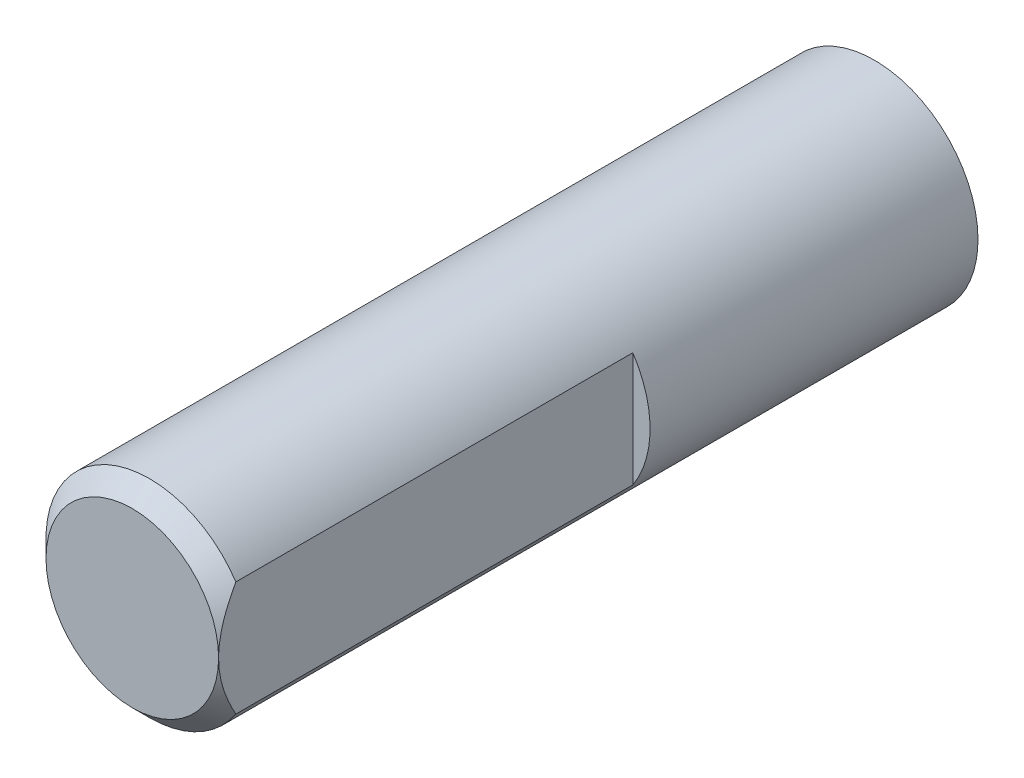
ISO-10303-21;
HEADER;
FILE_DESCRIPTION(('STEP AP214'),'2;1');
FILE_NAME('part.step','',(''),(''),'','','');
FILE_SCHEMA(('AUTOMOTIVE_DESIGN { 1 0 10303 214 1 1 1 1 }'));
ENDSEC;
DATA;
#1=APPLICATION_CONTEXT('core data for automotive mechanical design processes');
#2=APPLICATION_PROTOCOL_DEFINITION('international standard','automotive_design',2000,#1);
#3=PRODUCT_CONTEXT('',#1,'mechanical');
#4=PRODUCT('Part','Part','',(#3));
#5=PRODUCT_RELATED_PRODUCT_CATEGORY('part','',(#4));
#6=PRODUCT_DEFINITION_FORMATION('','',#4);
#7=PRODUCT_DEFINITION_CONTEXT('part definition',#1,'design');
#8=PRODUCT_DEFINITION('design','',#6,#7);
#9=PRODUCT_DEFINITION_SHAPE('','',#8);
#10=(LENGTH_UNIT() NAMED_UNIT(*) SI_UNIT(.MILLI.,.METRE.));
#11=(NAMED_UNIT(*) PLANE_ANGLE_UNIT() SI_UNIT($,.RADIAN.));
#12=(NAMED_UNIT(*) SI_UNIT($,.STERADIAN.) SOLID_ANGLE_UNIT());
#13=UNCERTAINTY_MEASURE_WITH_UNIT(LENGTH_MEASURE(1.E-05),#10,'distance_accuracy_value','');
#14=(GEOMETRIC_REPRESENTATION_CONTEXT(3) GLOBAL_UNCERTAINTY_ASSIGNED_CONTEXT((#13)) GLOBAL_UNIT_ASSIGNED_CONTEXT((#10,
#11,#12)) REPRESENTATION_CONTEXT('',''));
#15=CARTESIAN_POINT('',(0.,0.,0.));
#16=DIRECTION('',(0.,0.,1.));
#17=DIRECTION('',(1.,0.,0.));
#18=AXIS2_PLACEMENT_3D('',#15,#16,#17);
#19=CARTESIAN_POINT('',(0.,0.,21.5));
#20=DIRECTION('',(0.,0.,-1.));
#21=DIRECTION('',(-1.,0.,0.));
#22=AXIS2_PLACEMENT_3D('',#19,#20,#21);
#23=CYLINDRICAL_SURFACE('',#22,3.);
#24=DIRECTION('',(0.,0.,1.));
#25=VECTOR('',#24,1.);
#26=CARTESIAN_POINT('',(2.5,-1.6583123951777,9.5));
#27=LINE('',#26,#25);
#28=CARTESIAN_POINT('',(2.5,-1.6583123951777,9.5));
#29=VERTEX_POINT('',#28);
#30=CARTESIAN_POINT('',(2.5,-1.6583123951777,21.));
#31=VERTEX_POINT('',#30);
#32=EDGE_CURVE('E79',#29,#31,#27,.T.);
#33=ORIENTED_EDGE('',*,*,#32,.T.);
#34=CARTESIAN_POINT('',(0.,0.,21.));
#35=DIRECTION('',(0.,0.,1.));
#36=DIRECTION('',(1.,0.,0.));
#37=AXIS2_PLACEMENT_3D('',#34,#35,#36);
#38=CIRCLE('',#37,3.);
#39=CARTESIAN_POINT('',(2.5,1.6583123951777,21.));
#40=VERTEX_POINT('',#39);
#41=EDGE_CURVE('E11',#31,#40,#38,.F.);
#42=ORIENTED_EDGE('',*,*,#41,.T.);
#43=DIRECTION('',(0.,0.,1.));
#44=VECTOR('',#43,1.);
#45=CARTESIAN_POINT('',(2.5,1.6583123951777,9.5));
#46=LINE('',#45,#44);
#47=CARTESIAN_POINT('',(2.5,1.6583123951777,9.5));
#48=VERTEX_POINT('',#47);
#49=EDGE_CURVE('E77',#48,#40,#46,.T.);
#50=ORIENTED_EDGE('',*,*,#49,.F.);
#51=CARTESIAN_POINT('',(0.,0.,9.5));
#52=DIRECTION('',(0.,0.,1.));
#53=DIRECTION('',(1.,0.,0.));
#54=AXIS2_PLACEMENT_3D('',#51,#52,#53);
#55=CIRCLE('',#54,3.);
#56=EDGE_CURVE('E70',#29,#48,#55,.T.);
#57=ORIENTED_EDGE('',*,*,#56,.F.);
#58=EDGE_LOOP('',(#33,#42,#50,#57));
#59=FACE_BOUND('',#58,.T.);
#60=CARTESIAN_POINT('',(0.,0.,0.));
#61=DIRECTION('',(0.,0.,1.));
#62=DIRECTION('',(1.,0.,0.));
#63=AXIS2_PLACEMENT_3D('',#60,#61,#62);
#64=CIRCLE('',#63,3.);
#65=CARTESIAN_POINT('',(3.,0.,0.));
#66=VERTEX_POINT('',#65);
#67=EDGE_CURVE('E88',#66,#66,#64,.T.);
#68=ORIENTED_EDGE('',*,*,#67,.T.);
#69=EDGE_LOOP('',(#68));
#70=FACE_BOUND('',#69,.T.);
#71=ADVANCED_FACE('F38',(#59,#70),#23,.T.);
#72=CARTESIAN_POINT('',(0.,0.,21.5));
#73=DIRECTION('',(0.,0.,1.));
#74=DIRECTION('',(1.,0.,0.));
#75=AXIS2_PLACEMENT_3D('',#72,#73,#74);
#76=PLANE('',#75);
#77=CARTESIAN_POINT('',(0.,0.,21.5));
#78=DIRECTION('',(0.,0.,1.));
#79=DIRECTION('',(1.,0.,0.));
#80=AXIS2_PLACEMENT_3D('',#77,#78,#79);
#81=CIRCLE('',#80,2.5);
#82=CARTESIAN_POINT('',(2.5,0.,21.5));
#83=VERTEX_POINT('',#82);
#84=EDGE_CURVE('E94',#83,#83,#81,.T.);
#85=ORIENTED_EDGE('',*,*,#84,.T.);
#86=EDGE_LOOP('',(#85));
#87=FACE_BOUND('',#86,.T.);
#88=ADVANCED_FACE('F113',(#87),#76,.T.);
#89=CARTESIAN_POINT('',(0.,0.,0.));
#90=DIRECTION('',(0.,0.,1.));
#91=DIRECTION('',(1.,0.,0.));
#92=AXIS2_PLACEMENT_3D('',#89,#90,#91);
#93=PLANE('',#92);
#94=ORIENTED_EDGE('',*,*,#67,.F.);
#95=EDGE_LOOP('',(#94));
#96=FACE_BOUND('',#95,.T.);
#97=ADVANCED_FACE('F112',(#96),#93,.F.);
#98=CARTESIAN_POINT('',(2.5,1.6583123951777,9.5));
#99=DIRECTION('',(-1.,0.,0.));
#100=DIRECTION('',(0.,0.,1.));
#101=AXIS2_PLACEMENT_3D('',#98,#99,#100);
#102=PLANE('',#101);
#103=CARTESIAN_POINT('',(2.5,1.6583123951777,21.));
#104=CARTESIAN_POINT('',(2.5,1.61304419071273,21.0250200255843));
#105=CARTESIAN_POINT('',(2.5,1.56747781751027,21.049499427219));
#106=CARTESIAN_POINT('',(2.5,1.47571363154993,21.0972096867305));
#107=CARTESIAN_POINT('',(2.5,1.42951600534284,21.1204409038781));
#108=CARTESIAN_POINT('',(2.5,1.28946898250347,21.188233741468));
#109=CARTESIAN_POINT('',(2.5,1.19456817295725,21.2306685534991));
#110=CARTESIAN_POINT('',(2.5,1.00435832661106,21.3071641313579));
#111=CARTESIAN_POINT('',(2.5,0.909128166857117,21.3414185932365));
#112=CARTESIAN_POINT('',(2.5,0.715960996402805,21.4011186383457));
#113=CARTESIAN_POINT('',(2.5,0.618025975916641,21.4265705213043));
#114=CARTESIAN_POINT('',(2.5,0.434096531038006,21.46395141614));
#115=CARTESIAN_POINT('',(2.5,0.348395131920399,21.4772928993308));
#116=CARTESIAN_POINT('',(2.5,0.218706232970867,21.4908266543301));
#117=CARTESIAN_POINT('',(2.5,0.17504227488708,21.4942588205655));
#118=CARTESIAN_POINT('',(2.5,0.0875881850216984,21.4988484547413));
#119=CARTESIAN_POINT('',(2.5,0.0437980337548221,21.5000055502065));
#120=CARTESIAN_POINT('',(2.5,0.,21.5));
#121=B_SPLINE_CURVE_WITH_KNOTS('',3,(#103,#104,#105,#106,#107,#108,#109,#110,#111,#112,#113,
#114,#115,#116,#117,#118,#119,#120),.UNSPECIFIED.,.F.,.F.,(4,2,2,2,2,2,2,2,4),(0.,
0.155160114661541,0.310275326953931,0.621889187467566,0.925164565305232,1.22822244720193,
1.48798349653102,1.61932602447731,1.75069005406606),.UNSPECIFIED.);
#122=EDGE_CURVE('E97',#40,#83,#121,.T.);
#123=ORIENTED_EDGE('',*,*,#122,.T.);
#124=CARTESIAN_POINT('',(2.5,0.,21.5));
#125=CARTESIAN_POINT('',(2.5,-0.0768428391803911,21.5000643176381));
#126=CARTESIAN_POINT('',(2.5,-0.153646619440305,21.4964585669139));
#127=CARTESIAN_POINT('',(2.5,-0.306486913990631,21.4824138186156));
#128=CARTESIAN_POINT('',(2.5,-0.382524604614592,21.4719877566791));
#129=CARTESIAN_POINT('',(2.5,-0.532231201598341,21.4450231886171));
#130=CARTESIAN_POINT('',(2.5,-0.605918543015125,21.4285851348585));
#131=CARTESIAN_POINT('',(2.5,-0.751897163106768,21.3903277696489));
#132=CARTESIAN_POINT('',(2.5,-0.824187885624651,21.3685063602176));
#133=CARTESIAN_POINT('',(2.5,-0.961361204559369,21.3222417065684));
#134=CARTESIAN_POINT('',(2.5,-1.02636662586387,21.2981581621012));
#135=CARTESIAN_POINT('',(2.5,-1.15505562355539,21.2466971992364));
#136=CARTESIAN_POINT('',(2.5,-1.21873914323977,21.2193196398836));
#137=CARTESIAN_POINT('',(2.5,-1.34581351001767,21.1613450460911));
#138=CARTESIAN_POINT('',(2.5,-1.40918435962136,21.1307045192353));
#139=CARTESIAN_POINT('',(2.5,-1.53466113602633,21.067035036112));
#140=CARTESIAN_POINT('',(2.5,-1.59676793059763,21.0340077944289));
#141=CARTESIAN_POINT('',(2.5,-1.6583123951777,21.));
#142=B_SPLINE_CURVE_WITH_KNOTS('',3,(#124,#125,#126,#127,#128,#129,#130,#131,#132,#133,#134,
#135,#136,#137,#138,#139,#140,#141),.UNSPECIFIED.,.F.,.F.,(4,2,2,2,2,2,2,2,4),(0.,
0.230381722715165,0.460327757459297,0.686595219702824,0.912951001700758,1.120819357645,
1.32869661170077,1.53981070703045,1.75077462023261),.UNSPECIFIED.);
#143=EDGE_CURVE('E48',#83,#31,#142,.T.);
#144=ORIENTED_EDGE('',*,*,#143,.T.);
#145=ORIENTED_EDGE('',*,*,#32,.F.);
#146=DIRECTION('',(0.,-1.,0.));
#147=VECTOR('',#146,1.);
#148=CARTESIAN_POINT('',(2.5,1.6583123951777,9.5));
#149=LINE('',#148,#147);
#150=EDGE_CURVE('E73',#48,#29,#149,.T.);
#151=ORIENTED_EDGE('',*,*,#150,.F.);
#152=ORIENTED_EDGE('',*,*,#49,.T.);
#153=EDGE_LOOP('',(#123,#144,#145,#151,#152));
#154=FACE_BOUND('',#153,.T.);
#155=ADVANCED_FACE('F76',(#154),#102,.F.);
#156=CARTESIAN_POINT('',(0.,0.,9.5));
#157=DIRECTION('',(0.,0.,1.));
#158=DIRECTION('',(1.,0.,0.));
#159=AXIS2_PLACEMENT_3D('',#156,#157,#158);
#160=PLANE('',#159);
#161=ORIENTED_EDGE('',*,*,#56,.T.);
#162=ORIENTED_EDGE('',*,*,#150,.T.);
#163=EDGE_LOOP('',(#161,#162));
#164=FACE_BOUND('',#163,.T.);
#165=ADVANCED_FACE('F72',(#164),#160,.T.);
#166=CARTESIAN_POINT('',(0.,0.,21.5));
#167=DIRECTION('',(0.,0.,-1.));
#168=DIRECTION('',(-1.,0.,0.));
#169=AXIS2_PLACEMENT_3D('',#166,#167,#168);
#170=CONICAL_SURFACE('',#169,2.5,0.78539816339745);
#171=ORIENTED_EDGE('',*,*,#122,.F.);
#172=ORIENTED_EDGE('',*,*,#41,.F.);
#173=ORIENTED_EDGE('',*,*,#143,.F.);
#174=ORIENTED_EDGE('',*,*,#84,.F.);
#175=EDGE_LOOP('',(#171,#172,#173,#174));
#176=FACE_BOUND('',#175,.T.);
#177=ADVANCED_FACE('F40',(#176),#170,.T.);
#178=CLOSED_SHELL('',(#71,#88,#97,#155,#165,#177));
#179=MANIFOLD_SOLID_BREP('B2',#178);
#180=ADVANCED_BREP_SHAPE_REPRESENTATION('',(#18,#179),#14);
#181=SHAPE_DEFINITION_REPRESENTATION(#9,#180);
ENDSEC;
END-ISO-10303-21;
